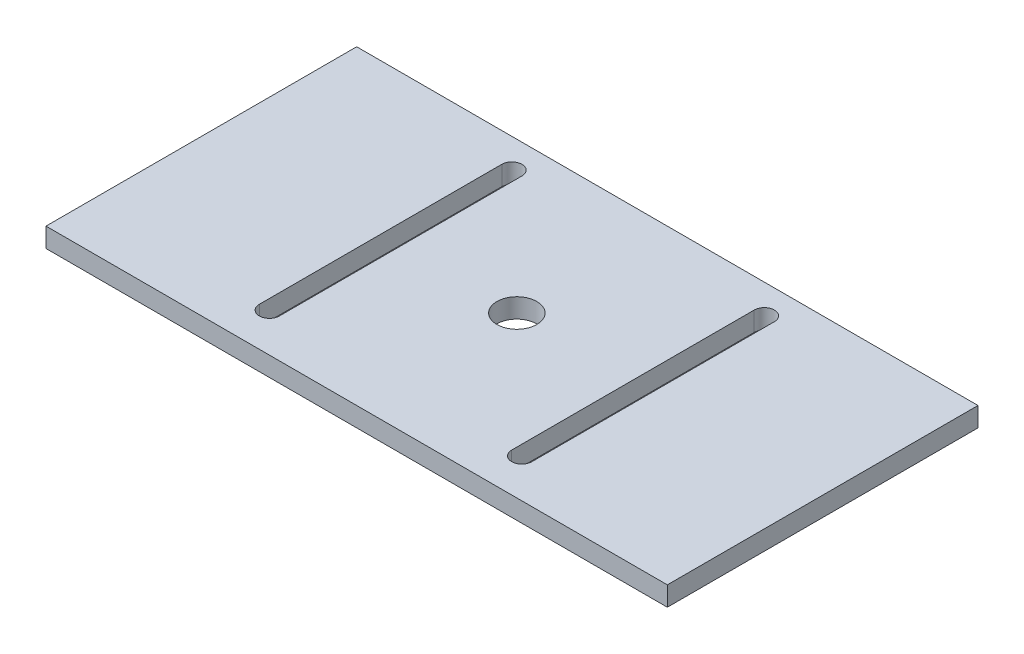
ISO-10303-21;
HEADER;
FILE_DESCRIPTION(('STEP AP214'),'2;1');
FILE_NAME('part.step','',(''),(''),'','','');
FILE_SCHEMA(('AUTOMOTIVE_DESIGN { 1 0 10303 214 1 1 1 1 }'));
ENDSEC;
DATA;
#1=APPLICATION_CONTEXT('core data for automotive mechanical design processes');
#2=APPLICATION_PROTOCOL_DEFINITION('international standard','automotive_design',2000,#1);
#3=PRODUCT_CONTEXT('',#1,'mechanical');
#4=PRODUCT('Part','Part','',(#3));
#5=PRODUCT_RELATED_PRODUCT_CATEGORY('part','',(#4));
#6=PRODUCT_DEFINITION_FORMATION('','',#4);
#7=PRODUCT_DEFINITION_CONTEXT('part definition',#1,'design');
#8=PRODUCT_DEFINITION('design','',#6,#7);
#9=PRODUCT_DEFINITION_SHAPE('','',#8);
#10=(LENGTH_UNIT() NAMED_UNIT(*) SI_UNIT(.MILLI.,.METRE.));
#11=(NAMED_UNIT(*) PLANE_ANGLE_UNIT() SI_UNIT($,.RADIAN.));
#12=(NAMED_UNIT(*) SI_UNIT($,.STERADIAN.) SOLID_ANGLE_UNIT());
#13=UNCERTAINTY_MEASURE_WITH_UNIT(LENGTH_MEASURE(1.E-05),#10,'distance_accuracy_value','');
#14=(GEOMETRIC_REPRESENTATION_CONTEXT(3) GLOBAL_UNCERTAINTY_ASSIGNED_CONTEXT((#13)) GLOBAL_UNIT_ASSIGNED_CONTEXT((#10,
#11,#12)) REPRESENTATION_CONTEXT('',''));
#15=CARTESIAN_POINT('',(0.,0.,0.));
#16=DIRECTION('',(0.,0.,1.));
#17=DIRECTION('',(1.,0.,0.));
#18=AXIS2_PLACEMENT_3D('',#15,#16,#17);
#19=CARTESIAN_POINT('',(0.,3.175,0.));
#20=DIRECTION('',(0.,-1.,0.));
#21=DIRECTION('',(0.,0.,-1.));
#22=AXIS2_PLACEMENT_3D('',#19,#20,#21);
#23=PLANE('',#22);
#24=CARTESIAN_POINT('',(30.1625,3.175,-6.36398232447062));
#25=DIRECTION('',(0.,1.,0.));
#26=DIRECTION('',(0.,0.,1.));
#27=AXIS2_PLACEMENT_3D('',#24,#25,#26);
#28=CIRCLE('',#27,1.651);
#29=CARTESIAN_POINT('',(28.5115,3.175,-6.36398232447062));
#30=VERTEX_POINT('',#29);
#31=CARTESIAN_POINT('',(31.8135,3.175,-6.36398232447062));
#32=VERTEX_POINT('',#31);
#33=EDGE_CURVE('E180',#30,#32,#28,.T.);
#34=ORIENTED_EDGE('',*,*,#33,.F.);
#35=DIRECTION('',(0.,0.,1.));
#36=VECTOR('',#35,1.);
#37=CARTESIAN_POINT('',(28.5115,3.175,-6.36398232447062));
#38=LINE('',#37,#36);
#39=CARTESIAN_POINT('',(28.5115,3.175,-46.0186225966823));
#40=VERTEX_POINT('',#39);
#41=EDGE_CURVE('E191',#40,#30,#38,.T.);
#42=ORIENTED_EDGE('',*,*,#41,.F.);
#43=CARTESIAN_POINT('',(30.1625,3.175,-46.0186225966823));
#44=DIRECTION('',(0.,1.,0.));
#45=DIRECTION('',(0.,0.,1.));
#46=AXIS2_PLACEMENT_3D('',#43,#44,#45);
#47=CIRCLE('',#46,1.651);
#48=CARTESIAN_POINT('',(31.8135,3.175,-46.0186225966823));
#49=VERTEX_POINT('',#48);
#50=EDGE_CURVE('E187',#49,#40,#47,.T.);
#51=ORIENTED_EDGE('',*,*,#50,.F.);
#52=DIRECTION('',(0.,0.,-1.));
#53=VECTOR('',#52,1.);
#54=CARTESIAN_POINT('',(31.8135,3.175,-6.36398232447062));
#55=LINE('',#54,#53);
#56=EDGE_CURVE('E183',#32,#49,#55,.T.);
#57=ORIENTED_EDGE('',*,*,#56,.F.);
#58=EDGE_LOOP('',(#34,#42,#51,#57));
#59=FACE_BOUND('',#58,.T.);
#60=DIRECTION('',(0.,0.,1.));
#61=VECTOR('',#60,1.);
#62=CARTESIAN_POINT('',(0.,3.175,0.));
#63=LINE('',#62,#61);
#64=CARTESIAN_POINT('',(0.,3.175,-50.8));
#65=VERTEX_POINT('',#64);
#66=CARTESIAN_POINT('',(0.,3.175,0.));
#67=VERTEX_POINT('',#66);
#68=EDGE_CURVE('E223',#65,#67,#63,.T.);
#69=ORIENTED_EDGE('',*,*,#68,.T.);
#70=DIRECTION('',(1.,0.,0.));
#71=VECTOR('',#70,1.);
#72=CARTESIAN_POINT('',(0.,3.175,0.));
#73=LINE('',#72,#71);
#74=CARTESIAN_POINT('',(101.6,3.175,0.));
#75=VERTEX_POINT('',#74);
#76=EDGE_CURVE('E227',#67,#75,#73,.T.);
#77=ORIENTED_EDGE('',*,*,#76,.T.);
#78=DIRECTION('',(0.,0.,-1.));
#79=VECTOR('',#78,1.);
#80=CARTESIAN_POINT('',(101.6,3.175,0.));
#81=LINE('',#80,#79);
#82=CARTESIAN_POINT('',(101.6,3.175,-50.8));
#83=VERTEX_POINT('',#82);
#84=EDGE_CURVE('E231',#75,#83,#81,.T.);
#85=ORIENTED_EDGE('',*,*,#84,.T.);
#86=DIRECTION('',(-1.,0.,0.));
#87=VECTOR('',#86,1.);
#88=CARTESIAN_POINT('',(0.,3.175,-50.8));
#89=LINE('',#88,#87);
#90=EDGE_CURVE('E234',#83,#65,#89,.T.);
#91=ORIENTED_EDGE('',*,*,#90,.T.);
#92=EDGE_LOOP('',(#69,#77,#85,#91));
#93=FACE_BOUND('',#92,.T.);
#94=CARTESIAN_POINT('',(71.4375,3.175,-6.36398232447062));
#95=DIRECTION('',(0.,1.,0.));
#96=DIRECTION('',(0.,0.,-1.));
#97=AXIS2_PLACEMENT_3D('',#94,#95,#96);
#98=CIRCLE('',#97,1.651);
#99=CARTESIAN_POINT('',(69.7865,3.175,-6.36398232447062));
#100=VERTEX_POINT('',#99);
#101=CARTESIAN_POINT('',(73.0885,3.175,-6.36398232447062));
#102=VERTEX_POINT('',#101);
#103=EDGE_CURVE('E129',#100,#102,#98,.T.);
#104=ORIENTED_EDGE('',*,*,#103,.F.);
#105=DIRECTION('',(0.,0.,1.));
#106=VECTOR('',#105,1.);
#107=CARTESIAN_POINT('',(69.7865,3.175,-6.36398232447062));
#108=LINE('',#107,#106);
#109=CARTESIAN_POINT('',(69.7865,3.175,-46.0186225966823));
#110=VERTEX_POINT('',#109);
#111=EDGE_CURVE('E156',#110,#100,#108,.T.);
#112=ORIENTED_EDGE('',*,*,#111,.F.);
#113=CARTESIAN_POINT('',(71.4375,3.175,-46.0186225966823));
#114=DIRECTION('',(0.,1.,0.));
#115=DIRECTION('',(0.,0.,-1.));
#116=AXIS2_PLACEMENT_3D('',#113,#114,#115);
#117=CIRCLE('',#116,1.651);
#118=CARTESIAN_POINT('',(73.0885,3.175,-46.0186225966823));
#119=VERTEX_POINT('',#118);
#120=EDGE_CURVE('E152',#119,#110,#117,.T.);
#121=ORIENTED_EDGE('',*,*,#120,.F.);
#122=DIRECTION('',(0.,0.,-1.));
#123=VECTOR('',#122,1.);
#124=CARTESIAN_POINT('',(73.0885,3.175,-6.36398232447062));
#125=LINE('',#124,#123);
#126=EDGE_CURVE('E138',#102,#119,#125,.T.);
#127=ORIENTED_EDGE('',*,*,#126,.F.);
#128=EDGE_LOOP('',(#104,#112,#121,#127));
#129=FACE_BOUND('',#128,.T.);
#130=CARTESIAN_POINT('',(50.8,3.175,-26.1913024605764));
#131=DIRECTION('',(0.,1.,0.));
#132=DIRECTION('',(0.,0.,1.));
#133=AXIS2_PLACEMENT_3D('',#130,#131,#132);
#134=CIRCLE('',#133,3.2639);
#135=CARTESIAN_POINT('',(50.8,3.175,-22.9274024605764));
#136=VERTEX_POINT('',#135);
#137=EDGE_CURVE('E164',#136,#136,#134,.T.);
#138=ORIENTED_EDGE('',*,*,#137,.F.);
#139=EDGE_LOOP('',(#138));
#140=FACE_BOUND('',#139,.T.);
#141=ADVANCED_FACE('F39',(#59,#93,#129,#140),#23,.F.);
#142=CARTESIAN_POINT('',(0.,0.,0.));
#143=DIRECTION('',(0.,-1.,0.));
#144=DIRECTION('',(0.,0.,-1.));
#145=AXIS2_PLACEMENT_3D('',#142,#143,#144);
#146=PLANE('',#145);
#147=DIRECTION('',(0.,0.,1.));
#148=VECTOR('',#147,1.);
#149=CARTESIAN_POINT('',(69.7865,0.,-6.36398232447062));
#150=LINE('',#149,#148);
#151=CARTESIAN_POINT('',(69.7865,0.,-46.0186225966823));
#152=VERTEX_POINT('',#151);
#153=CARTESIAN_POINT('',(69.7865,0.,-6.36398232447062));
#154=VERTEX_POINT('',#153);
#155=EDGE_CURVE('E139',#152,#154,#150,.T.);
#156=ORIENTED_EDGE('',*,*,#155,.T.);
#157=CARTESIAN_POINT('',(71.4375,0.,-6.36398232447062));
#158=DIRECTION('',(0.,1.,0.));
#159=DIRECTION('',(0.,0.,-1.));
#160=AXIS2_PLACEMENT_3D('',#157,#158,#159);
#161=CIRCLE('',#160,1.651);
#162=CARTESIAN_POINT('',(73.0885,0.,-6.36398232447062));
#163=VERTEX_POINT('',#162);
#164=EDGE_CURVE('E63',#154,#163,#161,.T.);
#165=ORIENTED_EDGE('',*,*,#164,.T.);
#166=DIRECTION('',(0.,0.,-1.));
#167=VECTOR('',#166,1.);
#168=CARTESIAN_POINT('',(73.0885,0.,-6.36398232447062));
#169=LINE('',#168,#167);
#170=CARTESIAN_POINT('',(73.0885,0.,-46.0186225966823));
#171=VERTEX_POINT('',#170);
#172=EDGE_CURVE('E145',#163,#171,#169,.T.);
#173=ORIENTED_EDGE('',*,*,#172,.T.);
#174=CARTESIAN_POINT('',(71.4375,0.,-46.0186225966823));
#175=DIRECTION('',(0.,1.,0.));
#176=DIRECTION('',(0.,0.,-1.));
#177=AXIS2_PLACEMENT_3D('',#174,#175,#176);
#178=CIRCLE('',#177,1.651);
#179=EDGE_CURVE('E167',#171,#152,#178,.T.);
#180=ORIENTED_EDGE('',*,*,#179,.T.);
#181=EDGE_LOOP('',(#156,#165,#173,#180));
#182=FACE_BOUND('',#181,.T.);
#183=DIRECTION('',(0.,0.,1.));
#184=VECTOR('',#183,1.);
#185=CARTESIAN_POINT('',(28.5115,0.,-6.36398232447062));
#186=LINE('',#185,#184);
#187=CARTESIAN_POINT('',(28.5115,0.,-46.0186225966823));
#188=VERTEX_POINT('',#187);
#189=CARTESIAN_POINT('',(28.5115,0.,-6.36398232447062));
#190=VERTEX_POINT('',#189);
#191=EDGE_CURVE('E184',#188,#190,#186,.T.);
#192=ORIENTED_EDGE('',*,*,#191,.T.);
#193=CARTESIAN_POINT('',(30.1625,0.,-6.36398232447062));
#194=DIRECTION('',(0.,1.,0.));
#195=DIRECTION('',(0.,0.,1.));
#196=AXIS2_PLACEMENT_3D('',#193,#194,#195);
#197=CIRCLE('',#196,1.651);
#198=CARTESIAN_POINT('',(31.8135,0.,-6.36398232447062));
#199=VERTEX_POINT('',#198);
#200=EDGE_CURVE('E147',#190,#199,#197,.T.);
#201=ORIENTED_EDGE('',*,*,#200,.T.);
#202=DIRECTION('',(0.,0.,-1.));
#203=VECTOR('',#202,1.);
#204=CARTESIAN_POINT('',(31.8135,0.,-6.36398232447062));
#205=LINE('',#204,#203);
#206=CARTESIAN_POINT('',(31.8135,0.,-46.0186225966823));
#207=VERTEX_POINT('',#206);
#208=EDGE_CURVE('E198',#199,#207,#205,.T.);
#209=ORIENTED_EDGE('',*,*,#208,.T.);
#210=CARTESIAN_POINT('',(30.1625,0.,-46.0186225966823));
#211=DIRECTION('',(0.,1.,0.));
#212=DIRECTION('',(0.,0.,1.));
#213=AXIS2_PLACEMENT_3D('',#210,#211,#212);
#214=CIRCLE('',#213,1.651);
#215=EDGE_CURVE('E202',#207,#188,#214,.T.);
#216=ORIENTED_EDGE('',*,*,#215,.T.);
#217=EDGE_LOOP('',(#192,#201,#209,#216));
#218=FACE_BOUND('',#217,.T.);
#219=DIRECTION('',(0.,0.,1.));
#220=VECTOR('',#219,1.);
#221=CARTESIAN_POINT('',(0.,0.,0.));
#222=LINE('',#221,#220);
#223=CARTESIAN_POINT('',(0.,0.,-50.8));
#224=VERTEX_POINT('',#223);
#225=CARTESIAN_POINT('',(0.,0.,0.));
#226=VERTEX_POINT('',#225);
#227=EDGE_CURVE('E222',#224,#226,#222,.T.);
#228=ORIENTED_EDGE('',*,*,#227,.F.);
#229=DIRECTION('',(-1.,0.,0.));
#230=VECTOR('',#229,1.);
#231=CARTESIAN_POINT('',(0.,0.,-50.8));
#232=LINE('',#231,#230);
#233=CARTESIAN_POINT('',(101.6,0.,-50.8));
#234=VERTEX_POINT('',#233);
#235=EDGE_CURVE('E228',#234,#224,#232,.T.);
#236=ORIENTED_EDGE('',*,*,#235,.F.);
#237=DIRECTION('',(0.,0.,-1.));
#238=VECTOR('',#237,1.);
#239=CARTESIAN_POINT('',(101.6,0.,0.));
#240=LINE('',#239,#238);
#241=CARTESIAN_POINT('',(101.6,0.,0.));
#242=VERTEX_POINT('',#241);
#243=EDGE_CURVE('E244',#242,#234,#240,.T.);
#244=ORIENTED_EDGE('',*,*,#243,.F.);
#245=DIRECTION('',(1.,0.,0.));
#246=VECTOR('',#245,1.);
#247=CARTESIAN_POINT('',(0.,0.,0.));
#248=LINE('',#247,#246);
#249=EDGE_CURVE('E241',#226,#242,#248,.T.);
#250=ORIENTED_EDGE('',*,*,#249,.F.);
#251=EDGE_LOOP('',(#228,#236,#244,#250));
#252=FACE_BOUND('',#251,.T.);
#253=CARTESIAN_POINT('',(50.8,0.,-26.1913024605764));
#254=DIRECTION('',(0.,1.,0.));
#255=DIRECTION('',(0.,0.,1.));
#256=AXIS2_PLACEMENT_3D('',#253,#254,#255);
#257=CIRCLE('',#256,3.2639);
#258=CARTESIAN_POINT('',(50.8,0.,-22.9274024605764));
#259=VERTEX_POINT('',#258);
#260=EDGE_CURVE('E348',#259,#259,#257,.T.);
#261=ORIENTED_EDGE('',*,*,#260,.T.);
#262=EDGE_LOOP('',(#261));
#263=FACE_BOUND('',#262,.T.);
#264=ADVANCED_FACE('F267',(#182,#218,#252,#263),#146,.T.);
#265=CARTESIAN_POINT('',(0.,3.175,0.));
#266=DIRECTION('',(1.,0.,0.));
#267=DIRECTION('',(0.,0.,-1.));
#268=AXIS2_PLACEMENT_3D('',#265,#266,#267);
#269=PLANE('',#268);
#270=ORIENTED_EDGE('',*,*,#227,.T.);
#271=DIRECTION('',(0.,-1.,0.));
#272=VECTOR('',#271,1.);
#273=CARTESIAN_POINT('',(0.,3.175,0.));
#274=LINE('',#273,#272);
#275=EDGE_CURVE('E11',#67,#226,#274,.T.);
#276=ORIENTED_EDGE('',*,*,#275,.F.);
#277=ORIENTED_EDGE('',*,*,#68,.F.);
#278=DIRECTION('',(0.,-1.,0.));
#279=VECTOR('',#278,1.);
#280=CARTESIAN_POINT('',(0.,3.175,-50.8));
#281=LINE('',#280,#279);
#282=EDGE_CURVE('E237',#65,#224,#281,.T.);
#283=ORIENTED_EDGE('',*,*,#282,.T.);
#284=EDGE_LOOP('',(#270,#276,#277,#283));
#285=FACE_BOUND('',#284,.T.);
#286=ADVANCED_FACE('F41',(#285),#269,.F.);
#287=CARTESIAN_POINT('',(0.,3.175,0.));
#288=DIRECTION('',(0.,0.,-1.));
#289=DIRECTION('',(-1.,0.,0.));
#290=AXIS2_PLACEMENT_3D('',#287,#288,#289);
#291=PLANE('',#290);
#292=ORIENTED_EDGE('',*,*,#249,.T.);
#293=DIRECTION('',(0.,-1.,0.));
#294=VECTOR('',#293,1.);
#295=CARTESIAN_POINT('',(101.6,3.175,0.));
#296=LINE('',#295,#294);
#297=EDGE_CURVE('E48',#75,#242,#296,.T.);
#298=ORIENTED_EDGE('',*,*,#297,.F.);
#299=ORIENTED_EDGE('',*,*,#76,.F.);
#300=ORIENTED_EDGE('',*,*,#275,.T.);
#301=EDGE_LOOP('',(#292,#298,#299,#300));
#302=FACE_BOUND('',#301,.T.);
#303=ADVANCED_FACE('F277',(#302),#291,.F.);
#304=CARTESIAN_POINT('',(101.6,3.175,0.));
#305=DIRECTION('',(-1.,0.,0.));
#306=DIRECTION('',(0.,0.,1.));
#307=AXIS2_PLACEMENT_3D('',#304,#305,#306);
#308=PLANE('',#307);
#309=ORIENTED_EDGE('',*,*,#243,.T.);
#310=DIRECTION('',(0.,-1.,0.));
#311=VECTOR('',#310,1.);
#312=CARTESIAN_POINT('',(101.6,3.175,-50.8));
#313=LINE('',#312,#311);
#314=EDGE_CURVE('E252',#83,#234,#313,.T.);
#315=ORIENTED_EDGE('',*,*,#314,.F.);
#316=ORIENTED_EDGE('',*,*,#84,.F.);
#317=ORIENTED_EDGE('',*,*,#297,.T.);
#318=EDGE_LOOP('',(#309,#315,#316,#317));
#319=FACE_BOUND('',#318,.T.);
#320=ADVANCED_FACE('F261',(#319),#308,.F.);
#321=CARTESIAN_POINT('',(0.,3.175,-50.8));
#322=DIRECTION('',(0.,0.,1.));
#323=DIRECTION('',(1.,0.,0.));
#324=AXIS2_PLACEMENT_3D('',#321,#322,#323);
#325=PLANE('',#324);
#326=ORIENTED_EDGE('',*,*,#235,.T.);
#327=ORIENTED_EDGE('',*,*,#282,.F.);
#328=ORIENTED_EDGE('',*,*,#90,.F.);
#329=ORIENTED_EDGE('',*,*,#314,.T.);
#330=EDGE_LOOP('',(#326,#327,#328,#329));
#331=FACE_BOUND('',#330,.T.);
#332=ADVANCED_FACE('F271',(#331),#325,.F.);
#333=CARTESIAN_POINT('',(30.1625,3.175,-6.36398232447062));
#334=DIRECTION('',(0.,-1.,0.));
#335=DIRECTION('',(0.,0.,-1.));
#336=AXIS2_PLACEMENT_3D('',#333,#334,#335);
#337=CYLINDRICAL_SURFACE('',#336,1.651);
#338=ORIENTED_EDGE('',*,*,#200,.F.);
#339=DIRECTION('',(0.,-1.,0.));
#340=VECTOR('',#339,1.);
#341=CARTESIAN_POINT('',(28.5115,3.175,-6.36398232447062));
#342=LINE('',#341,#340);
#343=EDGE_CURVE('E194',#30,#190,#342,.T.);
#344=ORIENTED_EDGE('',*,*,#343,.F.);
#345=ORIENTED_EDGE('',*,*,#33,.T.);
#346=DIRECTION('',(0.,-1.,0.));
#347=VECTOR('',#346,1.);
#348=CARTESIAN_POINT('',(31.8135,3.175,-6.36398232447062));
#349=LINE('',#348,#347);
#350=EDGE_CURVE('E218',#32,#199,#349,.T.);
#351=ORIENTED_EDGE('',*,*,#350,.T.);
#352=EDGE_LOOP('',(#338,#344,#345,#351));
#353=FACE_BOUND('',#352,.T.);
#354=ADVANCED_FACE('F294',(#353),#337,.F.);
#355=CARTESIAN_POINT('',(31.8135,3.175,-6.36398232447062));
#356=DIRECTION('',(-1.,0.,0.));
#357=DIRECTION('',(0.,0.,1.));
#358=AXIS2_PLACEMENT_3D('',#355,#356,#357);
#359=PLANE('',#358);
#360=ORIENTED_EDGE('',*,*,#208,.F.);
#361=ORIENTED_EDGE('',*,*,#350,.F.);
#362=ORIENTED_EDGE('',*,*,#56,.T.);
#363=DIRECTION('',(0.,-1.,0.));
#364=VECTOR('',#363,1.);
#365=CARTESIAN_POINT('',(31.8135,3.175,-46.0186225966823));
#366=LINE('',#365,#364);
#367=EDGE_CURVE('E215',#49,#207,#366,.T.);
#368=ORIENTED_EDGE('',*,*,#367,.T.);
#369=EDGE_LOOP('',(#360,#361,#362,#368));
#370=FACE_BOUND('',#369,.T.);
#371=ADVANCED_FACE('F301',(#370),#359,.T.);
#372=CARTESIAN_POINT('',(30.1625,3.175,-46.0186225966823));
#373=DIRECTION('',(0.,-1.,0.));
#374=DIRECTION('',(0.,0.,-1.));
#375=AXIS2_PLACEMENT_3D('',#372,#373,#374);
#376=CYLINDRICAL_SURFACE('',#375,1.651);
#377=ORIENTED_EDGE('',*,*,#215,.F.);
#378=ORIENTED_EDGE('',*,*,#367,.F.);
#379=ORIENTED_EDGE('',*,*,#50,.T.);
#380=DIRECTION('',(0.,-1.,0.));
#381=VECTOR('',#380,1.);
#382=CARTESIAN_POINT('',(28.5115,3.175,-46.0186225966823));
#383=LINE('',#382,#381);
#384=EDGE_CURVE('E212',#40,#188,#383,.T.);
#385=ORIENTED_EDGE('',*,*,#384,.T.);
#386=EDGE_LOOP('',(#377,#378,#379,#385));
#387=FACE_BOUND('',#386,.T.);
#388=ADVANCED_FACE('F306',(#387),#376,.F.);
#389=CARTESIAN_POINT('',(28.5115,3.175,-6.36398232447062));
#390=DIRECTION('',(1.,0.,0.));
#391=DIRECTION('',(0.,0.,-1.));
#392=AXIS2_PLACEMENT_3D('',#389,#390,#391);
#393=PLANE('',#392);
#394=ORIENTED_EDGE('',*,*,#191,.F.);
#395=ORIENTED_EDGE('',*,*,#384,.F.);
#396=ORIENTED_EDGE('',*,*,#41,.T.);
#397=ORIENTED_EDGE('',*,*,#343,.T.);
#398=EDGE_LOOP('',(#394,#395,#396,#397));
#399=FACE_BOUND('',#398,.T.);
#400=ADVANCED_FACE('F313',(#399),#393,.T.);
#401=CARTESIAN_POINT('',(71.4375,3.175,-6.36398232447062));
#402=DIRECTION('',(0.,-1.,0.));
#403=DIRECTION('',(0.,0.,-1.));
#404=AXIS2_PLACEMENT_3D('',#401,#402,#403);
#405=CYLINDRICAL_SURFACE('',#404,1.651);
#406=ORIENTED_EDGE('',*,*,#164,.F.);
#407=DIRECTION('',(0.,-1.,0.));
#408=VECTOR('',#407,1.);
#409=CARTESIAN_POINT('',(69.7865,3.175,-6.36398232447062));
#410=LINE('',#409,#408);
#411=EDGE_CURVE('E133',#100,#154,#410,.T.);
#412=ORIENTED_EDGE('',*,*,#411,.F.);
#413=ORIENTED_EDGE('',*,*,#103,.T.);
#414=DIRECTION('',(0.,-1.,0.));
#415=VECTOR('',#414,1.);
#416=CARTESIAN_POINT('',(73.0885,3.175,-6.36398232447062));
#417=LINE('',#416,#415);
#418=EDGE_CURVE('E132',#102,#163,#417,.T.);
#419=ORIENTED_EDGE('',*,*,#418,.T.);
#420=EDGE_LOOP('',(#406,#412,#413,#419));
#421=FACE_BOUND('',#420,.T.);
#422=ADVANCED_FACE('F131',(#421),#405,.F.);
#423=CARTESIAN_POINT('',(73.0885,3.175,-6.36398232447062));
#424=DIRECTION('',(-1.,0.,0.));
#425=DIRECTION('',(0.,0.,1.));
#426=AXIS2_PLACEMENT_3D('',#423,#424,#425);
#427=PLANE('',#426);
#428=ORIENTED_EDGE('',*,*,#172,.F.);
#429=ORIENTED_EDGE('',*,*,#418,.F.);
#430=ORIENTED_EDGE('',*,*,#126,.T.);
#431=DIRECTION('',(0.,-1.,0.));
#432=VECTOR('',#431,1.);
#433=CARTESIAN_POINT('',(73.0885,3.175,-46.0186225966823));
#434=LINE('',#433,#432);
#435=EDGE_CURVE('E148',#119,#171,#434,.T.);
#436=ORIENTED_EDGE('',*,*,#435,.T.);
#437=EDGE_LOOP('',(#428,#429,#430,#436));
#438=FACE_BOUND('',#437,.T.);
#439=ADVANCED_FACE('F142',(#438),#427,.T.);
#440=CARTESIAN_POINT('',(71.4375,3.175,-46.0186225966823));
#441=DIRECTION('',(0.,-1.,0.));
#442=DIRECTION('',(0.,0.,-1.));
#443=AXIS2_PLACEMENT_3D('',#440,#441,#442);
#444=CYLINDRICAL_SURFACE('',#443,1.651);
#445=ORIENTED_EDGE('',*,*,#179,.F.);
#446=ORIENTED_EDGE('',*,*,#435,.F.);
#447=ORIENTED_EDGE('',*,*,#120,.T.);
#448=DIRECTION('',(0.,-1.,0.));
#449=VECTOR('',#448,1.);
#450=CARTESIAN_POINT('',(69.7865,3.175,-46.0186225966823));
#451=LINE('',#450,#449);
#452=EDGE_CURVE('E55',#110,#152,#451,.T.);
#453=ORIENTED_EDGE('',*,*,#452,.T.);
#454=EDGE_LOOP('',(#445,#446,#447,#453));
#455=FACE_BOUND('',#454,.T.);
#456=ADVANCED_FACE('F331',(#455),#444,.F.);
#457=CARTESIAN_POINT('',(69.7865,3.175,-6.36398232447062));
#458=DIRECTION('',(1.,0.,0.));
#459=DIRECTION('',(0.,0.,-1.));
#460=AXIS2_PLACEMENT_3D('',#457,#458,#459);
#461=PLANE('',#460);
#462=ORIENTED_EDGE('',*,*,#155,.F.);
#463=ORIENTED_EDGE('',*,*,#452,.F.);
#464=ORIENTED_EDGE('',*,*,#111,.T.);
#465=ORIENTED_EDGE('',*,*,#411,.T.);
#466=EDGE_LOOP('',(#462,#463,#464,#465));
#467=FACE_BOUND('',#466,.T.);
#468=ADVANCED_FACE('F334',(#467),#461,.T.);
#469=CARTESIAN_POINT('',(50.8,3.175,-26.1913024605764));
#470=DIRECTION('',(0.,-1.,0.));
#471=DIRECTION('',(0.,0.,-1.));
#472=AXIS2_PLACEMENT_3D('',#469,#470,#471);
#473=CYLINDRICAL_SURFACE('',#472,3.2639);
#474=ORIENTED_EDGE('',*,*,#137,.T.);
#475=EDGE_LOOP('',(#474));
#476=FACE_BOUND('',#475,.T.);
#477=ORIENTED_EDGE('',*,*,#260,.F.);
#478=EDGE_LOOP('',(#477));
#479=FACE_BOUND('',#478,.T.);
#480=ADVANCED_FACE('F338',(#476,#479),#473,.F.);
#481=CLOSED_SHELL('',(#141,#264,#286,#303,#320,#332,#354,#371,#388,#400,#422,#439,#456,#468,#480));
#482=MANIFOLD_SOLID_BREP('B2',#481);
#483=ADVANCED_BREP_SHAPE_REPRESENTATION('',(#18,#482),#14);
#484=SHAPE_DEFINITION_REPRESENTATION(#9,#483);
ENDSEC;
END-ISO-10303-21;
